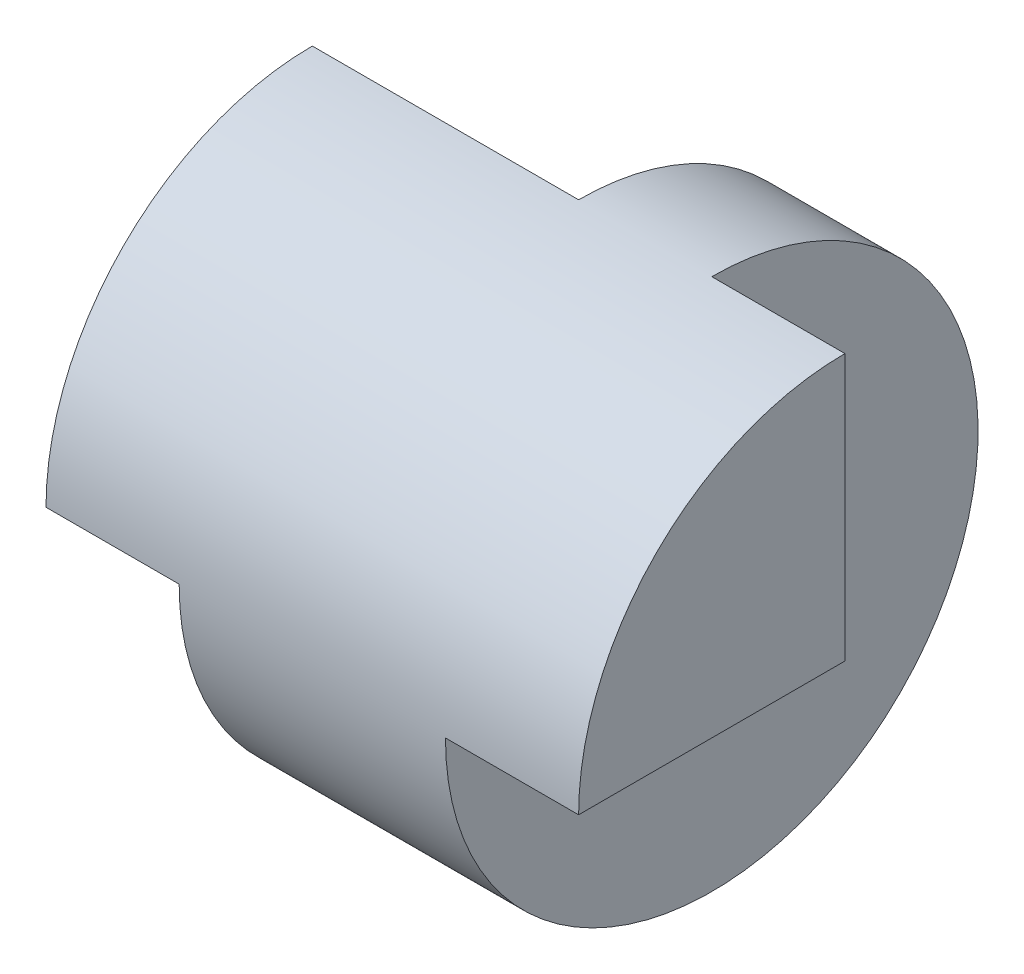
ISO-10303-21;
HEADER;
FILE_DESCRIPTION(('STEP AP214'),'2;1');
FILE_NAME('part.step','',(''),(''),'','','');
FILE_SCHEMA(('AUTOMOTIVE_DESIGN { 1 0 10303 214 1 1 1 1 }'));
ENDSEC;
DATA;
#1=APPLICATION_CONTEXT('core data for automotive mechanical design processes');
#2=APPLICATION_PROTOCOL_DEFINITION('international standard','automotive_design',2000,#1);
#3=PRODUCT_CONTEXT('',#1,'mechanical');
#4=PRODUCT('Part','Part','',(#3));
#5=PRODUCT_RELATED_PRODUCT_CATEGORY('part','',(#4));
#6=PRODUCT_DEFINITION_FORMATION('','',#4);
#7=PRODUCT_DEFINITION_CONTEXT('part definition',#1,'design');
#8=PRODUCT_DEFINITION('design','',#6,#7);
#9=PRODUCT_DEFINITION_SHAPE('','',#8);
#10=(LENGTH_UNIT() NAMED_UNIT(*) SI_UNIT(.MILLI.,.METRE.));
#11=(NAMED_UNIT(*) PLANE_ANGLE_UNIT() SI_UNIT($,.RADIAN.));
#12=(NAMED_UNIT(*) SI_UNIT($,.STERADIAN.) SOLID_ANGLE_UNIT());
#13=UNCERTAINTY_MEASURE_WITH_UNIT(LENGTH_MEASURE(1.E-05),#10,'distance_accuracy_value','');
#14=(GEOMETRIC_REPRESENTATION_CONTEXT(3) GLOBAL_UNCERTAINTY_ASSIGNED_CONTEXT((#13)) GLOBAL_UNIT_ASSIGNED_CONTEXT((#10,
#11,#12)) REPRESENTATION_CONTEXT('',''));
#15=CARTESIAN_POINT('',(0.,0.,0.));
#16=DIRECTION('',(0.,0.,1.));
#17=DIRECTION('',(1.,0.,0.));
#18=AXIS2_PLACEMENT_3D('',#15,#16,#17);
#19=CARTESIAN_POINT('',(0.,0.,0.));
#20=DIRECTION('',(-1.,0.,0.));
#21=DIRECTION('',(0.,0.,1.));
#22=AXIS2_PLACEMENT_3D('',#19,#20,#21);
#23=CYLINDRICAL_SURFACE('',#22,2.);
#24=DIRECTION('',(-1.,0.,0.));
#25=VECTOR('',#24,1.);
#26=CARTESIAN_POINT('',(0.,2.,0.));
#27=LINE('',#26,#25);
#28=CARTESIAN_POINT('',(0.,2.,0.));
#29=VERTEX_POINT('',#28);
#30=CARTESIAN_POINT('',(2.,2.,0.));
#31=VERTEX_POINT('',#30);
#32=EDGE_CURVE('E131',#29,#31,#27,.F.);
#33=ORIENTED_EDGE('',*,*,#32,.F.);
#34=CARTESIAN_POINT('',(0.,0.,0.));
#35=DIRECTION('',(-1.,0.,0.));
#36=DIRECTION('',(0.,0.,1.));
#37=AXIS2_PLACEMENT_3D('',#34,#35,#36);
#38=CIRCLE('',#37,2.);
#39=CARTESIAN_POINT('',(0.,0.,2.));
#40=VERTEX_POINT('',#39);
#41=EDGE_CURVE('E146',#40,#29,#38,.T.);
#42=ORIENTED_EDGE('',*,*,#41,.F.);
#43=DIRECTION('',(-1.,0.,0.));
#44=VECTOR('',#43,1.);
#45=CARTESIAN_POINT('',(0.,0.,2.));
#46=LINE('',#45,#44);
#47=CARTESIAN_POINT('',(1.,0.,2.));
#48=VERTEX_POINT('',#47);
#49=EDGE_CURVE('E141',#48,#40,#46,.T.);
#50=ORIENTED_EDGE('',*,*,#49,.F.);
#51=CARTESIAN_POINT('',(1.,0.,0.));
#52=DIRECTION('',(-1.,0.,0.));
#53=DIRECTION('',(0.,-1.,0.));
#54=AXIS2_PLACEMENT_3D('',#51,#52,#53);
#55=CIRCLE('',#54,2.);
#56=CARTESIAN_POINT('',(1.,0.,-2.));
#57=VERTEX_POINT('',#56);
#58=EDGE_CURVE('E116',#48,#57,#55,.F.);
#59=ORIENTED_EDGE('',*,*,#58,.T.);
#60=DIRECTION('',(1.,0.,0.));
#61=VECTOR('',#60,1.);
#62=CARTESIAN_POINT('',(0.,0.,-2.));
#63=LINE('',#62,#61);
#64=CARTESIAN_POINT('',(2.,0.,-2.));
#65=VERTEX_POINT('',#64);
#66=EDGE_CURVE('E107',#57,#65,#63,.T.);
#67=ORIENTED_EDGE('',*,*,#66,.T.);
#68=CARTESIAN_POINT('',(2.,0.,0.));
#69=DIRECTION('',(1.,0.,0.));
#70=DIRECTION('',(0.,1.,0.));
#71=AXIS2_PLACEMENT_3D('',#68,#69,#70);
#72=CIRCLE('',#71,2.);
#73=EDGE_CURVE('E11',#31,#65,#72,.F.);
#74=ORIENTED_EDGE('',*,*,#73,.F.);
#75=EDGE_LOOP('',(#33,#42,#50,#59,#67,#74));
#76=FACE_BOUND('',#75,.T.);
#77=DIRECTION('',(-1.,0.,0.));
#78=VECTOR('',#77,1.);
#79=CARTESIAN_POINT('',(0.,2.,0.));
#80=LINE('',#79,#78);
#81=CARTESIAN_POINT('',(3.,2.,0.));
#82=VERTEX_POINT('',#81);
#83=CARTESIAN_POINT('',(4.,2.,0.));
#84=VERTEX_POINT('',#83);
#85=EDGE_CURVE('E125',#82,#84,#80,.F.);
#86=ORIENTED_EDGE('',*,*,#85,.F.);
#87=CARTESIAN_POINT('',(3.,0.,0.));
#88=DIRECTION('',(1.,0.,0.));
#89=DIRECTION('',(0.,0.,-1.));
#90=AXIS2_PLACEMENT_3D('',#87,#88,#89);
#91=CIRCLE('',#90,2.);
#92=CARTESIAN_POINT('',(3.,0.,2.));
#93=VERTEX_POINT('',#92);
#94=EDGE_CURVE('E40',#82,#93,#91,.F.);
#95=ORIENTED_EDGE('',*,*,#94,.T.);
#96=DIRECTION('',(-1.,0.,0.));
#97=VECTOR('',#96,1.);
#98=CARTESIAN_POINT('',(0.,0.,2.));
#99=LINE('',#98,#97);
#100=CARTESIAN_POINT('',(4.,0.,2.));
#101=VERTEX_POINT('',#100);
#102=EDGE_CURVE('E135',#101,#93,#99,.T.);
#103=ORIENTED_EDGE('',*,*,#102,.F.);
#104=CARTESIAN_POINT('',(4.,0.,0.));
#105=DIRECTION('',(-1.,0.,0.));
#106=DIRECTION('',(0.,0.,1.));
#107=AXIS2_PLACEMENT_3D('',#104,#105,#106);
#108=CIRCLE('',#107,2.);
#109=EDGE_CURVE('E143',#101,#84,#108,.T.);
#110=ORIENTED_EDGE('',*,*,#109,.T.);
#111=EDGE_LOOP('',(#86,#95,#103,#110));
#112=FACE_BOUND('',#111,.T.);
#113=ADVANCED_FACE('F33',(#76,#112),#23,.T.);
#114=CARTESIAN_POINT('',(0.,-2.,0.));
#115=DIRECTION('',(1.,0.,0.));
#116=DIRECTION('',(0.,0.,-1.));
#117=AXIS2_PLACEMENT_3D('',#114,#115,#116);
#118=PLANE('',#117);
#119=ORIENTED_EDGE('',*,*,#41,.T.);
#120=DIRECTION('',(0.,-1.,0.));
#121=VECTOR('',#120,1.);
#122=CARTESIAN_POINT('',(0.,10.,0.));
#123=LINE('',#122,#121);
#124=CARTESIAN_POINT('',(0.,0.,0.));
#125=VERTEX_POINT('',#124);
#126=EDGE_CURVE('E123',#29,#125,#123,.T.);
#127=ORIENTED_EDGE('',*,*,#126,.T.);
#128=DIRECTION('',(0.,0.,1.));
#129=VECTOR('',#128,1.);
#130=CARTESIAN_POINT('',(0.,0.,0.));
#131=LINE('',#130,#129);
#132=EDGE_CURVE('E55',#125,#40,#131,.T.);
#133=ORIENTED_EDGE('',*,*,#132,.T.);
#134=EDGE_LOOP('',(#119,#127,#133));
#135=FACE_BOUND('',#134,.T.);
#136=ADVANCED_FACE('F167',(#135),#118,.F.);
#137=CARTESIAN_POINT('',(4.,0.,0.));
#138=DIRECTION('',(-1.,0.,0.));
#139=DIRECTION('',(0.,0.,1.));
#140=AXIS2_PLACEMENT_3D('',#137,#138,#139);
#141=PLANE('',#140);
#142=DIRECTION('',(0.,0.,-1.));
#143=VECTOR('',#142,1.);
#144=CARTESIAN_POINT('',(4.,0.,0.));
#145=LINE('',#144,#143);
#146=CARTESIAN_POINT('',(4.,0.,0.));
#147=VERTEX_POINT('',#146);
#148=EDGE_CURVE('E150',#101,#147,#145,.T.);
#149=ORIENTED_EDGE('',*,*,#148,.T.);
#150=DIRECTION('',(0.,-1.,0.));
#151=VECTOR('',#150,1.);
#152=CARTESIAN_POINT('',(4.,10.,0.));
#153=LINE('',#152,#151);
#154=EDGE_CURVE('E47',#84,#147,#153,.T.);
#155=ORIENTED_EDGE('',*,*,#154,.F.);
#156=ORIENTED_EDGE('',*,*,#109,.F.);
#157=EDGE_LOOP('',(#149,#155,#156));
#158=FACE_BOUND('',#157,.T.);
#159=ADVANCED_FACE('F164',(#158),#141,.F.);
#160=CARTESIAN_POINT('',(0.,0.,-5.5));
#161=DIRECTION('',(0.,1.,0.));
#162=DIRECTION('',(-1.,0.,0.));
#163=AXIS2_PLACEMENT_3D('',#160,#161,#162);
#164=PLANE('',#163);
#165=ORIENTED_EDGE('',*,*,#132,.F.);
#166=DIRECTION('',(-1.,0.,0.));
#167=VECTOR('',#166,1.);
#168=CARTESIAN_POINT('',(0.,0.,0.));
#169=LINE('',#168,#167);
#170=CARTESIAN_POINT('',(1.,0.,0.));
#171=VERTEX_POINT('',#170);
#172=EDGE_CURVE('E111',#171,#125,#169,.T.);
#173=ORIENTED_EDGE('',*,*,#172,.F.);
#174=DIRECTION('',(0.,0.,1.));
#175=VECTOR('',#174,1.);
#176=CARTESIAN_POINT('',(1.,0.,-5.5));
#177=LINE('',#176,#175);
#178=EDGE_CURVE('E138',#171,#48,#177,.T.);
#179=ORIENTED_EDGE('',*,*,#178,.T.);
#180=ORIENTED_EDGE('',*,*,#49,.T.);
#181=EDGE_LOOP('',(#165,#173,#179,#180));
#182=FACE_BOUND('',#181,.T.);
#183=ADVANCED_FACE('F166',(#182),#164,.F.);
#184=CARTESIAN_POINT('',(1.,0.,-5.5));
#185=DIRECTION('',(-1.,0.,0.));
#186=DIRECTION('',(0.,-1.,0.));
#187=AXIS2_PLACEMENT_3D('',#184,#185,#186);
#188=PLANE('',#187);
#189=ORIENTED_EDGE('',*,*,#58,.F.);
#190=ORIENTED_EDGE('',*,*,#178,.F.);
#191=EDGE_CURVE('E139',#57,#171,#177,.T.);
#192=ORIENTED_EDGE('',*,*,#191,.F.);
#193=EDGE_LOOP('',(#189,#190,#192));
#194=FACE_BOUND('',#193,.T.);
#195=ADVANCED_FACE('F173',(#194),#188,.T.);
#196=CARTESIAN_POINT('',(3.,0.,-5.5));
#197=DIRECTION('',(1.,0.,0.));
#198=DIRECTION('',(0.,0.,-1.));
#199=AXIS2_PLACEMENT_3D('',#196,#197,#198);
#200=PLANE('',#199);
#201=ORIENTED_EDGE('',*,*,#94,.F.);
#202=DIRECTION('',(0.,-1.,0.));
#203=VECTOR('',#202,1.);
#204=CARTESIAN_POINT('',(3.,10.,0.));
#205=LINE('',#204,#203);
#206=CARTESIAN_POINT('',(3.,0.,0.));
#207=VERTEX_POINT('',#206);
#208=EDGE_CURVE('E118',#82,#207,#205,.T.);
#209=ORIENTED_EDGE('',*,*,#208,.T.);
#210=DIRECTION('',(0.,0.,1.));
#211=VECTOR('',#210,1.);
#212=CARTESIAN_POINT('',(3.,0.,-5.5));
#213=LINE('',#212,#211);
#214=EDGE_CURVE('E133',#207,#93,#213,.T.);
#215=ORIENTED_EDGE('',*,*,#214,.T.);
#216=EDGE_LOOP('',(#201,#209,#215));
#217=FACE_BOUND('',#216,.T.);
#218=ADVANCED_FACE('F158',(#217),#200,.T.);
#219=CARTESIAN_POINT('',(0.,0.,-5.5));
#220=DIRECTION('',(0.,1.,0.));
#221=DIRECTION('',(-1.,0.,0.));
#222=AXIS2_PLACEMENT_3D('',#219,#220,#221);
#223=PLANE('',#222);
#224=ORIENTED_EDGE('',*,*,#214,.F.);
#225=DIRECTION('',(-1.,0.,0.));
#226=VECTOR('',#225,1.);
#227=CARTESIAN_POINT('',(4.,0.,0.));
#228=LINE('',#227,#226);
#229=EDGE_CURVE('E127',#147,#207,#228,.T.);
#230=ORIENTED_EDGE('',*,*,#229,.F.);
#231=ORIENTED_EDGE('',*,*,#148,.F.);
#232=ORIENTED_EDGE('',*,*,#102,.T.);
#233=EDGE_LOOP('',(#224,#230,#231,#232));
#234=FACE_BOUND('',#233,.T.);
#235=ADVANCED_FACE('F162',(#234),#223,.F.);
#236=CARTESIAN_POINT('',(4.,10.,0.));
#237=DIRECTION('',(0.,0.,1.));
#238=DIRECTION('',(1.,0.,0.));
#239=AXIS2_PLACEMENT_3D('',#236,#237,#238);
#240=PLANE('',#239);
#241=ORIENTED_EDGE('',*,*,#85,.T.);
#242=ORIENTED_EDGE('',*,*,#154,.T.);
#243=ORIENTED_EDGE('',*,*,#229,.T.);
#244=ORIENTED_EDGE('',*,*,#208,.F.);
#245=EDGE_LOOP('',(#241,#242,#243,#244));
#246=FACE_BOUND('',#245,.T.);
#247=ADVANCED_FACE('F160',(#246),#240,.F.);
#248=CARTESIAN_POINT('',(0.,10.,0.));
#249=DIRECTION('',(0.,0.,1.));
#250=DIRECTION('',(1.,0.,0.));
#251=AXIS2_PLACEMENT_3D('',#248,#249,#250);
#252=PLANE('',#251);
#253=ORIENTED_EDGE('',*,*,#32,.T.);
#254=DIRECTION('',(0.,-1.,0.));
#255=VECTOR('',#254,1.);
#256=CARTESIAN_POINT('',(2.,10.,0.));
#257=LINE('',#256,#255);
#258=CARTESIAN_POINT('',(2.,0.,0.));
#259=VERTEX_POINT('',#258);
#260=EDGE_CURVE('E101',#31,#259,#257,.T.);
#261=ORIENTED_EDGE('',*,*,#260,.T.);
#262=EDGE_CURVE('E110',#259,#171,#169,.T.);
#263=ORIENTED_EDGE('',*,*,#262,.T.);
#264=ORIENTED_EDGE('',*,*,#172,.T.);
#265=ORIENTED_EDGE('',*,*,#126,.F.);
#266=EDGE_LOOP('',(#253,#261,#263,#264,#265));
#267=FACE_BOUND('',#266,.T.);
#268=ADVANCED_FACE('F228',(#267),#252,.F.);
#269=CARTESIAN_POINT('',(2.,10.,-2.));
#270=DIRECTION('',(1.,0.,0.));
#271=DIRECTION('',(0.,1.,0.));
#272=AXIS2_PLACEMENT_3D('',#269,#270,#271);
#273=PLANE('',#272);
#274=ORIENTED_EDGE('',*,*,#73,.T.);
#275=DIRECTION('',(0.,0.,1.));
#276=VECTOR('',#275,1.);
#277=CARTESIAN_POINT('',(2.,0.,-2.));
#278=LINE('',#277,#276);
#279=EDGE_CURVE('E99',#65,#259,#278,.T.);
#280=ORIENTED_EDGE('',*,*,#279,.T.);
#281=ORIENTED_EDGE('',*,*,#260,.F.);
#282=EDGE_LOOP('',(#274,#280,#281));
#283=FACE_BOUND('',#282,.T.);
#284=ADVANCED_FACE('F98',(#283),#273,.F.);
#285=CARTESIAN_POINT('',(0.,0.,0.));
#286=DIRECTION('',(0.,1.,0.));
#287=DIRECTION('',(-1.,0.,0.));
#288=AXIS2_PLACEMENT_3D('',#285,#286,#287);
#289=PLANE('',#288);
#290=ORIENTED_EDGE('',*,*,#262,.F.);
#291=ORIENTED_EDGE('',*,*,#279,.F.);
#292=ORIENTED_EDGE('',*,*,#66,.F.);
#293=ORIENTED_EDGE('',*,*,#191,.T.);
#294=EDGE_LOOP('',(#290,#291,#292,#293));
#295=FACE_BOUND('',#294,.T.);
#296=ADVANCED_FACE('F106',(#295),#289,.T.);
#297=CLOSED_SHELL('',(#113,#136,#159,#183,#195,#218,#235,#247,#268,#284,#296));
#298=MANIFOLD_SOLID_BREP('B2',#297);
#299=ADVANCED_BREP_SHAPE_REPRESENTATION('',(#18,#298),#14);
#300=SHAPE_DEFINITION_REPRESENTATION(#9,#299);
ENDSEC;
END-ISO-10303-21;
